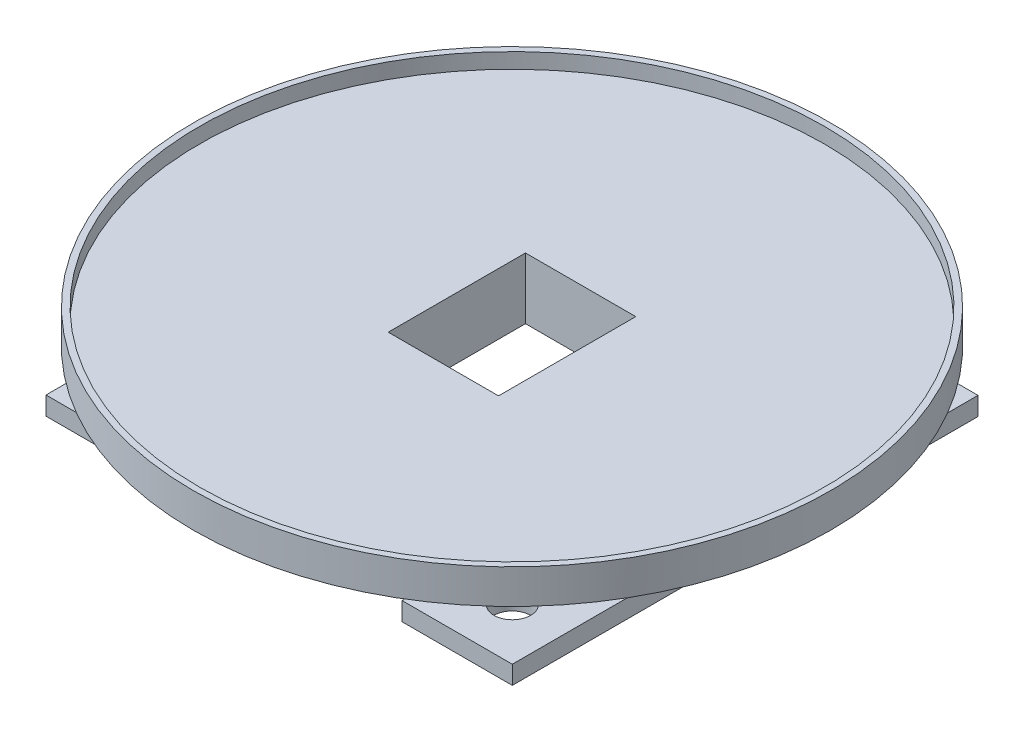
ISO-10303-21;
HEADER;
FILE_DESCRIPTION(('STEP AP214'),'2;1');
FILE_NAME('part.step','',(''),(''),'','','');
FILE_SCHEMA(('AUTOMOTIVE_DESIGN { 1 0 10303 214 1 1 1 1 }'));
ENDSEC;
DATA;
#1=APPLICATION_CONTEXT('core data for automotive mechanical design processes');
#2=APPLICATION_PROTOCOL_DEFINITION('international standard','automotive_design',2000,#1);
#3=PRODUCT_CONTEXT('',#1,'mechanical');
#4=PRODUCT('Part','Part','',(#3));
#5=PRODUCT_RELATED_PRODUCT_CATEGORY('part','',(#4));
#6=PRODUCT_DEFINITION_FORMATION('','',#4);
#7=PRODUCT_DEFINITION_CONTEXT('part definition',#1,'design');
#8=PRODUCT_DEFINITION('design','',#6,#7);
#9=PRODUCT_DEFINITION_SHAPE('','',#8);
#10=(LENGTH_UNIT() NAMED_UNIT(*) SI_UNIT(.MILLI.,.METRE.));
#11=(NAMED_UNIT(*) PLANE_ANGLE_UNIT() SI_UNIT($,.RADIAN.));
#12=(NAMED_UNIT(*) SI_UNIT($,.STERADIAN.) SOLID_ANGLE_UNIT());
#13=UNCERTAINTY_MEASURE_WITH_UNIT(LENGTH_MEASURE(1.E-05),#10,'distance_accuracy_value','');
#14=(GEOMETRIC_REPRESENTATION_CONTEXT(3) GLOBAL_UNCERTAINTY_ASSIGNED_CONTEXT((#13)) GLOBAL_UNIT_ASSIGNED_CONTEXT((#10,
#11,#12)) REPRESENTATION_CONTEXT('',''));
#15=CARTESIAN_POINT('',(0.,0.,0.));
#16=DIRECTION('',(0.,0.,1.));
#17=DIRECTION('',(1.,0.,0.));
#18=AXIS2_PLACEMENT_3D('',#15,#16,#17);
#19=CARTESIAN_POINT('',(0.,-5.,0.));
#20=DIRECTION('',(0.,-1.,0.));
#21=DIRECTION('',(0.,0.,-1.));
#22=AXIS2_PLACEMENT_3D('',#19,#20,#21);
#23=PLANE('',#22);
#24=DIRECTION('',(-1.,0.,0.));
#25=VECTOR('',#24,1.);
#26=CARTESIAN_POINT('',(-4.5,-5.,5.6));
#27=LINE('',#26,#25);
#28=CARTESIAN_POINT('',(4.5,-5.,5.6));
#29=VERTEX_POINT('',#28);
#30=CARTESIAN_POINT('',(-4.5,-5.,5.6));
#31=VERTEX_POINT('',#30);
#32=EDGE_CURVE('E305',#29,#31,#27,.T.);
#33=ORIENTED_EDGE('',*,*,#32,.F.);
#34=DIRECTION('',(0.,0.,1.));
#35=VECTOR('',#34,1.);
#36=CARTESIAN_POINT('',(4.5,-5.,-5.6));
#37=LINE('',#36,#35);
#38=CARTESIAN_POINT('',(4.5,-5.,-5.6));
#39=VERTEX_POINT('',#38);
#40=EDGE_CURVE('E302',#39,#29,#37,.T.);
#41=ORIENTED_EDGE('',*,*,#40,.F.);
#42=DIRECTION('',(1.,0.,0.));
#43=VECTOR('',#42,1.);
#44=CARTESIAN_POINT('',(-4.5,-5.,-5.6));
#45=LINE('',#44,#43);
#46=CARTESIAN_POINT('',(-4.5,-5.,-5.6));
#47=VERTEX_POINT('',#46);
#48=EDGE_CURVE('E312',#47,#39,#45,.T.);
#49=ORIENTED_EDGE('',*,*,#48,.F.);
#50=DIRECTION('',(0.,0.,-1.));
#51=VECTOR('',#50,1.);
#52=CARTESIAN_POINT('',(-4.5,-5.,-5.6));
#53=LINE('',#52,#51);
#54=EDGE_CURVE('E309',#31,#47,#53,.T.);
#55=ORIENTED_EDGE('',*,*,#54,.F.);
#56=EDGE_LOOP('',(#33,#41,#49,#55));
#57=FACE_BOUND('',#56,.T.);
#58=DIRECTION('',(0.,0.,1.));
#59=VECTOR('',#58,1.);
#60=CARTESIAN_POINT('',(-10.025,-5.,-19.));
#61=LINE('',#60,#59);
#62=CARTESIAN_POINT('',(-10.025,-5.,-12.4699388530979));
#63=VERTEX_POINT('',#62);
#64=CARTESIAN_POINT('',(-10.025,-5.,12.4699388530979));
#65=VERTEX_POINT('',#64);
#66=EDGE_CURVE('E266',#63,#65,#61,.T.);
#67=ORIENTED_EDGE('',*,*,#66,.F.);
#68=CARTESIAN_POINT('',(0.,-5.,0.));
#69=DIRECTION('',(0.,-1.,0.));
#70=DIRECTION('',(0.,0.,-1.));
#71=AXIS2_PLACEMENT_3D('',#68,#69,#70);
#72=CIRCLE('',#71,16.);
#73=CARTESIAN_POINT('',(10.025,-5.,-12.4699388530979));
#74=VERTEX_POINT('',#73);
#75=EDGE_CURVE('E255',#63,#74,#72,.T.);
#76=ORIENTED_EDGE('',*,*,#75,.T.);
#77=DIRECTION('',(0.,0.,1.));
#78=VECTOR('',#77,1.);
#79=CARTESIAN_POINT('',(10.025,-5.,-19.));
#80=LINE('',#79,#78);
#81=CARTESIAN_POINT('',(10.025,-5.,12.4699388530979));
#82=VERTEX_POINT('',#81);
#83=EDGE_CURVE('E249',#74,#82,#80,.T.);
#84=ORIENTED_EDGE('',*,*,#83,.T.);
#85=EDGE_CURVE('E258',#82,#65,#72,.T.);
#86=ORIENTED_EDGE('',*,*,#85,.T.);
#87=EDGE_LOOP('',(#67,#76,#84,#86));
#88=FACE_BOUND('',#87,.T.);
#89=ADVANCED_FACE('F109',(#57,#88),#23,.T.);
#90=CARTESIAN_POINT('',(0.,-78.5391052434009,0.));
#91=DIRECTION('',(0.,1.,0.));
#92=DIRECTION('',(0.,0.,1.));
#93=AXIS2_PLACEMENT_3D('',#90,#91,#92);
#94=CYLINDRICAL_SURFACE('',#93,26.);
#95=CARTESIAN_POINT('',(0.,1.25,0.));
#96=DIRECTION('',(0.,1.,0.));
#97=DIRECTION('',(0.,0.,1.));
#98=AXIS2_PLACEMENT_3D('',#95,#96,#97);
#99=CIRCLE('',#98,26.);
#100=CARTESIAN_POINT('',(0.,1.25,26.));
#101=VERTEX_POINT('',#100);
#102=EDGE_CURVE('E716',#101,#101,#99,.T.);
#103=ORIENTED_EDGE('',*,*,#102,.F.);
#104=EDGE_LOOP('',(#103));
#105=FACE_BOUND('',#104,.T.);
#106=CARTESIAN_POINT('',(0.,-1.55,0.));
#107=DIRECTION('',(0.,-1.,0.));
#108=DIRECTION('',(0.,0.,-1.));
#109=AXIS2_PLACEMENT_3D('',#106,#107,#108);
#110=CIRCLE('',#109,26.);
#111=CARTESIAN_POINT('',(0.,-1.55,-26.));
#112=VERTEX_POINT('',#111);
#113=EDGE_CURVE('E270',#112,#112,#110,.T.);
#114=ORIENTED_EDGE('',*,*,#113,.F.);
#115=EDGE_LOOP('',(#114));
#116=FACE_BOUND('',#115,.T.);
#117=ADVANCED_FACE('F351',(#105,#116),#94,.T.);
#118=CARTESIAN_POINT('',(0.,0.,0.));
#119=DIRECTION('',(0.,-1.,0.));
#120=DIRECTION('',(0.,0.,-1.));
#121=AXIS2_PLACEMENT_3D('',#118,#119,#120);
#122=PLANE('',#121);
#123=CARTESIAN_POINT('',(0.,0.,0.));
#124=DIRECTION('',(0.,-1.,0.));
#125=DIRECTION('',(0.,0.,-1.));
#126=AXIS2_PLACEMENT_3D('',#123,#124,#125);
#127=CIRCLE('',#126,25.5);
#128=CARTESIAN_POINT('',(0.,0.,-25.5));
#129=VERTEX_POINT('',#128);
#130=EDGE_CURVE('E113',#129,#129,#127,.T.);
#131=ORIENTED_EDGE('',*,*,#130,.F.);
#132=EDGE_LOOP('',(#131));
#133=FACE_BOUND('',#132,.T.);
#134=DIRECTION('',(0.,0.,1.));
#135=VECTOR('',#134,1.);
#136=CARTESIAN_POINT('',(4.5,0.,-5.6));
#137=LINE('',#136,#135);
#138=CARTESIAN_POINT('',(4.5,0.,-5.6));
#139=VERTEX_POINT('',#138);
#140=CARTESIAN_POINT('',(4.5,0.,5.6));
#141=VERTEX_POINT('',#140);
#142=EDGE_CURVE('E290',#139,#141,#137,.T.);
#143=ORIENTED_EDGE('',*,*,#142,.T.);
#144=DIRECTION('',(-1.,0.,0.));
#145=VECTOR('',#144,1.);
#146=CARTESIAN_POINT('',(-4.5,0.,5.6));
#147=LINE('',#146,#145);
#148=CARTESIAN_POINT('',(-4.5,0.,5.6));
#149=VERTEX_POINT('',#148);
#150=EDGE_CURVE('E319',#141,#149,#147,.T.);
#151=ORIENTED_EDGE('',*,*,#150,.T.);
#152=DIRECTION('',(0.,0.,-1.));
#153=VECTOR('',#152,1.);
#154=CARTESIAN_POINT('',(-4.5,0.,-5.6));
#155=LINE('',#154,#153);
#156=CARTESIAN_POINT('',(-4.5,0.,-5.6));
#157=VERTEX_POINT('',#156);
#158=EDGE_CURVE('E323',#149,#157,#155,.T.);
#159=ORIENTED_EDGE('',*,*,#158,.T.);
#160=DIRECTION('',(1.,0.,0.));
#161=VECTOR('',#160,1.);
#162=CARTESIAN_POINT('',(-4.5,0.,-5.6));
#163=LINE('',#162,#161);
#164=EDGE_CURVE('E306',#157,#139,#163,.T.);
#165=ORIENTED_EDGE('',*,*,#164,.T.);
#166=EDGE_LOOP('',(#143,#151,#159,#165));
#167=FACE_BOUND('',#166,.T.);
#168=ADVANCED_FACE('F111',(#133,#167),#122,.F.);
#169=CARTESIAN_POINT('',(4.5,-5.,-5.6));
#170=DIRECTION('',(-1.,0.,0.));
#171=DIRECTION('',(0.,0.,1.));
#172=AXIS2_PLACEMENT_3D('',#169,#170,#171);
#173=PLANE('',#172);
#174=ORIENTED_EDGE('',*,*,#142,.F.);
#175=DIRECTION('',(0.,1.,0.));
#176=VECTOR('',#175,1.);
#177=CARTESIAN_POINT('',(4.5,-5.,-5.6));
#178=LINE('',#177,#176);
#179=EDGE_CURVE('E315',#39,#139,#178,.T.);
#180=ORIENTED_EDGE('',*,*,#179,.F.);
#181=ORIENTED_EDGE('',*,*,#40,.T.);
#182=DIRECTION('',(0.,1.,0.));
#183=VECTOR('',#182,1.);
#184=CARTESIAN_POINT('',(4.5,-5.,5.6));
#185=LINE('',#184,#183);
#186=EDGE_CURVE('E337',#29,#141,#185,.T.);
#187=ORIENTED_EDGE('',*,*,#186,.T.);
#188=EDGE_LOOP('',(#174,#180,#181,#187));
#189=FACE_BOUND('',#188,.T.);
#190=ADVANCED_FACE('F350',(#189),#173,.T.);
#191=CARTESIAN_POINT('',(-4.5,-5.,5.6));
#192=DIRECTION('',(0.,0.,-1.));
#193=DIRECTION('',(-1.,0.,0.));
#194=AXIS2_PLACEMENT_3D('',#191,#192,#193);
#195=PLANE('',#194);
#196=ORIENTED_EDGE('',*,*,#150,.F.);
#197=ORIENTED_EDGE('',*,*,#186,.F.);
#198=ORIENTED_EDGE('',*,*,#32,.T.);
#199=DIRECTION('',(0.,1.,0.));
#200=VECTOR('',#199,1.);
#201=CARTESIAN_POINT('',(-4.5,-5.,5.6));
#202=LINE('',#201,#200);
#203=EDGE_CURVE('E335',#31,#149,#202,.T.);
#204=ORIENTED_EDGE('',*,*,#203,.T.);
#205=EDGE_LOOP('',(#196,#197,#198,#204));
#206=FACE_BOUND('',#205,.T.);
#207=ADVANCED_FACE('F360',(#206),#195,.T.);
#208=CARTESIAN_POINT('',(-4.5,-5.,-5.6));
#209=DIRECTION('',(1.,0.,0.));
#210=DIRECTION('',(0.,0.,-1.));
#211=AXIS2_PLACEMENT_3D('',#208,#209,#210);
#212=PLANE('',#211);
#213=ORIENTED_EDGE('',*,*,#158,.F.);
#214=ORIENTED_EDGE('',*,*,#203,.F.);
#215=ORIENTED_EDGE('',*,*,#54,.T.);
#216=DIRECTION('',(0.,1.,0.));
#217=VECTOR('',#216,1.);
#218=CARTESIAN_POINT('',(-4.5,-5.,-5.6));
#219=LINE('',#218,#217);
#220=EDGE_CURVE('E135',#47,#157,#219,.T.);
#221=ORIENTED_EDGE('',*,*,#220,.T.);
#222=EDGE_LOOP('',(#213,#214,#215,#221));
#223=FACE_BOUND('',#222,.T.);
#224=ADVANCED_FACE('F364',(#223),#212,.T.);
#225=CARTESIAN_POINT('',(-4.5,-5.,-5.6));
#226=DIRECTION('',(0.,0.,1.));
#227=DIRECTION('',(1.,0.,0.));
#228=AXIS2_PLACEMENT_3D('',#225,#226,#227);
#229=PLANE('',#228);
#230=ORIENTED_EDGE('',*,*,#164,.F.);
#231=ORIENTED_EDGE('',*,*,#220,.F.);
#232=ORIENTED_EDGE('',*,*,#48,.T.);
#233=ORIENTED_EDGE('',*,*,#179,.T.);
#234=EDGE_LOOP('',(#230,#231,#232,#233));
#235=FACE_BOUND('',#234,.T.);
#236=ADVANCED_FACE('F354',(#235),#229,.T.);
#237=CARTESIAN_POINT('',(0.,-5.,0.));
#238=DIRECTION('',(0.,1.,0.));
#239=DIRECTION('',(0.,0.,1.));
#240=AXIS2_PLACEMENT_3D('',#237,#238,#239);
#241=PLANE('',#240);
#242=DIRECTION('',(0.,0.,-1.));
#243=VECTOR('',#242,1.);
#244=CARTESIAN_POINT('',(19.025,-5.,19.));
#245=LINE('',#244,#243);
#246=CARTESIAN_POINT('',(19.025,-5.,19.));
#247=VERTEX_POINT('',#246);
#248=CARTESIAN_POINT('',(19.025,-5.,-19.));
#249=VERTEX_POINT('',#248);
#250=EDGE_CURVE('E12',#247,#249,#245,.T.);
#251=ORIENTED_EDGE('',*,*,#250,.T.);
#252=DIRECTION('',(-1.,0.,0.));
#253=VECTOR('',#252,1.);
#254=CARTESIAN_POINT('',(19.025,-5.,-19.));
#255=LINE('',#254,#253);
#256=CARTESIAN_POINT('',(10.025,-5.00000000000001,-19.));
#257=VERTEX_POINT('',#256);
#258=EDGE_CURVE('E119',#249,#257,#255,.T.);
#259=ORIENTED_EDGE('',*,*,#258,.T.);
#260=EDGE_CURVE('E237',#257,#74,#80,.T.);
#261=ORIENTED_EDGE('',*,*,#260,.T.);
#262=EDGE_CURVE('E241',#74,#82,#72,.T.);
#263=ORIENTED_EDGE('',*,*,#262,.T.);
#264=DIRECTION('',(0.,0.,1.));
#265=VECTOR('',#264,1.);
#266=CARTESIAN_POINT('',(10.025,-5.00000000000001,-19.));
#267=LINE('',#266,#265);
#268=CARTESIAN_POINT('',(10.025,-5.00000000000001,19.));
#269=VERTEX_POINT('',#268);
#270=EDGE_CURVE('E273',#82,#269,#267,.T.);
#271=ORIENTED_EDGE('',*,*,#270,.T.);
#272=DIRECTION('',(-1.,0.,0.));
#273=VECTOR('',#272,1.);
#274=CARTESIAN_POINT('',(19.025,-5.,19.));
#275=LINE('',#274,#273);
#276=EDGE_CURVE('E282',#247,#269,#275,.T.);
#277=ORIENTED_EDGE('',*,*,#276,.F.);
#278=EDGE_LOOP('',(#251,#259,#261,#263,#271,#277));
#279=FACE_BOUND('',#278,.T.);
#280=CARTESIAN_POINT('',(14.825,-5.,-14.8));
#281=DIRECTION('',(0.,-1.,0.));
#282=DIRECTION('',(0.,0.,-1.));
#283=AXIS2_PLACEMENT_3D('',#280,#281,#282);
#284=CIRCLE('',#283,1.5);
#285=CARTESIAN_POINT('',(14.825,-5.,-16.3));
#286=VERTEX_POINT('',#285);
#287=EDGE_CURVE('E690',#286,#286,#284,.T.);
#288=ORIENTED_EDGE('',*,*,#287,.T.);
#289=EDGE_LOOP('',(#288));
#290=FACE_BOUND('',#289,.T.);
#291=CARTESIAN_POINT('',(14.825,-5.,14.8));
#292=DIRECTION('',(0.,-1.,0.));
#293=DIRECTION('',(0.,0.,-1.));
#294=AXIS2_PLACEMENT_3D('',#291,#292,#293);
#295=CIRCLE('',#294,1.5);
#296=CARTESIAN_POINT('',(14.825,-5.,13.3));
#297=VERTEX_POINT('',#296);
#298=EDGE_CURVE('E774',#297,#297,#295,.T.);
#299=ORIENTED_EDGE('',*,*,#298,.T.);
#300=EDGE_LOOP('',(#299));
#301=FACE_BOUND('',#300,.T.);
#302=ADVANCED_FACE('F239',(#279,#290,#301),#241,.T.);
#303=CARTESIAN_POINT('',(0.,-6.5,0.));
#304=DIRECTION('',(0.,1.,0.));
#305=DIRECTION('',(0.,0.,1.));
#306=AXIS2_PLACEMENT_3D('',#303,#304,#305);
#307=PLANE('',#306);
#308=DIRECTION('',(0.,0.,-1.));
#309=VECTOR('',#308,1.);
#310=CARTESIAN_POINT('',(16.8685915988111,-6.5,-7.62390848108858));
#311=LINE('',#310,#309);
#312=CARTESIAN_POINT('',(16.8685915988111,-6.5,-7.62390848108858));
#313=VERTEX_POINT('',#312);
#314=CARTESIAN_POINT('',(16.8685915988111,-6.5,-10.6239084810886));
#315=VERTEX_POINT('',#314);
#316=EDGE_CURVE('E689',#313,#315,#311,.T.);
#317=ORIENTED_EDGE('',*,*,#316,.T.);
#318=DIRECTION('',(1.,0.,0.));
#319=VECTOR('',#318,1.);
#320=CARTESIAN_POINT('',(12.8685915988111,-6.5,-10.6239084810886));
#321=LINE('',#320,#319);
#322=CARTESIAN_POINT('',(12.8685915988111,-6.5,-10.6239084810886));
#323=VERTEX_POINT('',#322);
#324=EDGE_CURVE('E127',#323,#315,#321,.T.);
#325=ORIENTED_EDGE('',*,*,#324,.F.);
#326=DIRECTION('',(0.,0.,-1.));
#327=VECTOR('',#326,1.);
#328=CARTESIAN_POINT('',(12.8685915988111,-6.5,-7.62390848108858));
#329=LINE('',#328,#327);
#330=CARTESIAN_POINT('',(12.8685915988111,-6.5,-7.62390848108858));
#331=VERTEX_POINT('',#330);
#332=EDGE_CURVE('E676',#331,#323,#329,.T.);
#333=ORIENTED_EDGE('',*,*,#332,.F.);
#334=DIRECTION('',(1.,0.,0.));
#335=VECTOR('',#334,1.);
#336=CARTESIAN_POINT('',(12.8685915988111,-6.5,-7.62390848108858));
#337=LINE('',#336,#335);
#338=EDGE_CURVE('E694',#331,#313,#337,.T.);
#339=ORIENTED_EDGE('',*,*,#338,.T.);
#340=EDGE_LOOP('',(#317,#325,#333,#339));
#341=FACE_BOUND('',#340,.T.);
#342=DIRECTION('',(0.,0.,-1.));
#343=VECTOR('',#342,1.);
#344=CARTESIAN_POINT('',(19.025,-6.5,19.));
#345=LINE('',#344,#343);
#346=CARTESIAN_POINT('',(19.025,-6.5,19.));
#347=VERTEX_POINT('',#346);
#348=CARTESIAN_POINT('',(19.025,-6.5,-19.));
#349=VERTEX_POINT('',#348);
#350=EDGE_CURVE('E248',#347,#349,#345,.T.);
#351=ORIENTED_EDGE('',*,*,#350,.F.);
#352=DIRECTION('',(-1.,0.,0.));
#353=VECTOR('',#352,1.);
#354=CARTESIAN_POINT('',(19.025,-6.5,19.));
#355=LINE('',#354,#353);
#356=CARTESIAN_POINT('',(10.025,-6.5,19.));
#357=VERTEX_POINT('',#356);
#358=EDGE_CURVE('E301',#347,#357,#355,.T.);
#359=ORIENTED_EDGE('',*,*,#358,.T.);
#360=DIRECTION('',(0.,0.,1.));
#361=VECTOR('',#360,1.);
#362=CARTESIAN_POINT('',(10.025,-6.5,-19.));
#363=LINE('',#362,#361);
#364=CARTESIAN_POINT('',(10.025,-6.5,-19.));
#365=VERTEX_POINT('',#364);
#366=EDGE_CURVE('E794',#365,#357,#363,.T.);
#367=ORIENTED_EDGE('',*,*,#366,.F.);
#368=DIRECTION('',(-1.,0.,0.));
#369=VECTOR('',#368,1.);
#370=CARTESIAN_POINT('',(19.025,-6.5,-19.));
#371=LINE('',#370,#369);
#372=EDGE_CURVE('E790',#349,#365,#371,.T.);
#373=ORIENTED_EDGE('',*,*,#372,.F.);
#374=EDGE_LOOP('',(#351,#359,#367,#373));
#375=FACE_BOUND('',#374,.T.);
#376=CARTESIAN_POINT('',(14.825,-6.5,-14.8));
#377=DIRECTION('',(0.,-1.,0.));
#378=DIRECTION('',(0.,0.,-1.));
#379=AXIS2_PLACEMENT_3D('',#376,#377,#378);
#380=CIRCLE('',#379,1.5);
#381=CARTESIAN_POINT('',(14.825,-6.5,-16.3));
#382=VERTEX_POINT('',#381);
#383=EDGE_CURVE('E275',#382,#382,#380,.T.);
#384=ORIENTED_EDGE('',*,*,#383,.F.);
#385=EDGE_LOOP('',(#384));
#386=FACE_BOUND('',#385,.T.);
#387=CARTESIAN_POINT('',(14.825,-6.5,14.8));
#388=DIRECTION('',(0.,-1.,0.));
#389=DIRECTION('',(0.,0.,-1.));
#390=AXIS2_PLACEMENT_3D('',#387,#388,#389);
#391=CIRCLE('',#390,1.5);
#392=CARTESIAN_POINT('',(14.825,-6.5,13.3));
#393=VERTEX_POINT('',#392);
#394=EDGE_CURVE('E278',#393,#393,#391,.T.);
#395=ORIENTED_EDGE('',*,*,#394,.F.);
#396=EDGE_LOOP('',(#395));
#397=FACE_BOUND('',#396,.T.);
#398=ADVANCED_FACE('F412',(#341,#375,#386,#397),#307,.F.);
#399=CARTESIAN_POINT('',(19.025,-6.5,19.));
#400=DIRECTION('',(1.,0.,0.));
#401=DIRECTION('',(0.,0.,-1.));
#402=AXIS2_PLACEMENT_3D('',#399,#400,#401);
#403=PLANE('',#402);
#404=ORIENTED_EDGE('',*,*,#250,.F.);
#405=DIRECTION('',(0.,1.,0.));
#406=VECTOR('',#405,1.);
#407=CARTESIAN_POINT('',(19.025,-6.5,19.));
#408=LINE('',#407,#406);
#409=EDGE_CURVE('E286',#347,#247,#408,.T.);
#410=ORIENTED_EDGE('',*,*,#409,.F.);
#411=ORIENTED_EDGE('',*,*,#350,.T.);
#412=DIRECTION('',(0.,1.,0.));
#413=VECTOR('',#412,1.);
#414=CARTESIAN_POINT('',(19.025,-6.5,-19.));
#415=LINE('',#414,#413);
#416=EDGE_CURVE('E297',#349,#249,#415,.T.);
#417=ORIENTED_EDGE('',*,*,#416,.T.);
#418=EDGE_LOOP('',(#404,#410,#411,#417));
#419=FACE_BOUND('',#418,.T.);
#420=ADVANCED_FACE('F427',(#419),#403,.T.);
#421=CARTESIAN_POINT('',(19.025,-6.5,19.));
#422=DIRECTION('',(0.,0.,-1.));
#423=DIRECTION('',(-1.,0.,0.));
#424=AXIS2_PLACEMENT_3D('',#421,#422,#423);
#425=PLANE('',#424);
#426=ORIENTED_EDGE('',*,*,#409,.T.);
#427=ORIENTED_EDGE('',*,*,#276,.T.);
#428=DIRECTION('',(0.,1.,0.));
#429=VECTOR('',#428,1.);
#430=CARTESIAN_POINT('',(10.025,-6.5,19.));
#431=LINE('',#430,#429);
#432=EDGE_CURVE('E291',#357,#269,#431,.T.);
#433=ORIENTED_EDGE('',*,*,#432,.F.);
#434=ORIENTED_EDGE('',*,*,#358,.F.);
#435=EDGE_LOOP('',(#426,#427,#433,#434));
#436=FACE_BOUND('',#435,.T.);
#437=ADVANCED_FACE('F442',(#436),#425,.F.);
#438=CARTESIAN_POINT('',(10.025,-6.5,-19.));
#439=DIRECTION('',(-1.,0.,0.));
#440=DIRECTION('',(0.,0.,1.));
#441=AXIS2_PLACEMENT_3D('',#438,#439,#440);
#442=PLANE('',#441);
#443=ORIENTED_EDGE('',*,*,#260,.F.);
#444=DIRECTION('',(0.,1.,0.));
#445=VECTOR('',#444,1.);
#446=CARTESIAN_POINT('',(10.025,-6.5,-19.));
#447=LINE('',#446,#445);
#448=EDGE_CURVE('E294',#365,#257,#447,.T.);
#449=ORIENTED_EDGE('',*,*,#448,.F.);
#450=ORIENTED_EDGE('',*,*,#366,.T.);
#451=ORIENTED_EDGE('',*,*,#432,.T.);
#452=ORIENTED_EDGE('',*,*,#270,.F.);
#453=ORIENTED_EDGE('',*,*,#83,.F.);
#454=EDGE_LOOP('',(#443,#449,#450,#451,#452,#453));
#455=FACE_BOUND('',#454,.T.);
#456=ADVANCED_FACE('F271',(#455),#442,.T.);
#457=CARTESIAN_POINT('',(19.025,-6.5,-19.));
#458=DIRECTION('',(0.,0.,-1.));
#459=DIRECTION('',(-1.,0.,0.));
#460=AXIS2_PLACEMENT_3D('',#457,#458,#459);
#461=PLANE('',#460);
#462=ORIENTED_EDGE('',*,*,#258,.F.);
#463=ORIENTED_EDGE('',*,*,#416,.F.);
#464=ORIENTED_EDGE('',*,*,#372,.T.);
#465=ORIENTED_EDGE('',*,*,#448,.T.);
#466=EDGE_LOOP('',(#462,#463,#464,#465));
#467=FACE_BOUND('',#466,.T.);
#468=ADVANCED_FACE('F461',(#467),#461,.T.);
#469=CARTESIAN_POINT('',(14.825,-6.5,-14.8));
#470=DIRECTION('',(0.,1.,0.));
#471=DIRECTION('',(0.,0.,1.));
#472=AXIS2_PLACEMENT_3D('',#469,#470,#471);
#473=CYLINDRICAL_SURFACE('',#472,1.5);
#474=ORIENTED_EDGE('',*,*,#383,.T.);
#475=EDGE_LOOP('',(#474));
#476=FACE_BOUND('',#475,.T.);
#477=ORIENTED_EDGE('',*,*,#287,.F.);
#478=EDGE_LOOP('',(#477));
#479=FACE_BOUND('',#478,.T.);
#480=ADVANCED_FACE('F470',(#476,#479),#473,.F.);
#481=CARTESIAN_POINT('',(14.825,-6.5,14.8));
#482=DIRECTION('',(0.,1.,0.));
#483=DIRECTION('',(0.,0.,1.));
#484=AXIS2_PLACEMENT_3D('',#481,#482,#483);
#485=CYLINDRICAL_SURFACE('',#484,1.5);
#486=ORIENTED_EDGE('',*,*,#394,.T.);
#487=EDGE_LOOP('',(#486));
#488=FACE_BOUND('',#487,.T.);
#489=ORIENTED_EDGE('',*,*,#298,.F.);
#490=EDGE_LOOP('',(#489));
#491=FACE_BOUND('',#490,.T.);
#492=ADVANCED_FACE('F480',(#488,#491),#485,.F.);
#493=CARTESIAN_POINT('',(0.,-5.,0.));
#494=DIRECTION('',(0.,-1.,0.));
#495=DIRECTION('',(0.,0.,-1.));
#496=AXIS2_PLACEMENT_3D('',#493,#494,#495);
#497=PLANE('',#496);
#498=DIRECTION('',(0.,0.,-1.));
#499=VECTOR('',#498,1.);
#500=CARTESIAN_POINT('',(-19.025,-5.,19.));
#501=LINE('',#500,#499);
#502=CARTESIAN_POINT('',(-19.025,-5.,19.));
#503=VERTEX_POINT('',#502);
#504=CARTESIAN_POINT('',(-19.025,-5.,-19.));
#505=VERTEX_POINT('',#504);
#506=EDGE_CURVE('E743',#503,#505,#501,.T.);
#507=ORIENTED_EDGE('',*,*,#506,.F.);
#508=DIRECTION('',(-1.,0.,0.));
#509=VECTOR('',#508,1.);
#510=CARTESIAN_POINT('',(-10.025,-5.,19.));
#511=LINE('',#510,#509);
#512=CARTESIAN_POINT('',(-10.025,-5.00000000000001,19.));
#513=VERTEX_POINT('',#512);
#514=EDGE_CURVE('E740',#513,#503,#511,.T.);
#515=ORIENTED_EDGE('',*,*,#514,.F.);
#516=DIRECTION('',(0.,0.,1.));
#517=VECTOR('',#516,1.);
#518=CARTESIAN_POINT('',(-10.025,-5.00000000000001,-19.));
#519=LINE('',#518,#517);
#520=EDGE_CURVE('E260',#65,#513,#519,.T.);
#521=ORIENTED_EDGE('',*,*,#520,.F.);
#522=EDGE_CURVE('E269',#65,#63,#72,.T.);
#523=ORIENTED_EDGE('',*,*,#522,.T.);
#524=CARTESIAN_POINT('',(-10.025,-5.00000000000001,-19.));
#525=VERTEX_POINT('',#524);
#526=EDGE_CURVE('E737',#525,#63,#61,.T.);
#527=ORIENTED_EDGE('',*,*,#526,.F.);
#528=DIRECTION('',(-1.,0.,0.));
#529=VECTOR('',#528,1.);
#530=CARTESIAN_POINT('',(-10.025,-5.,-19.));
#531=LINE('',#530,#529);
#532=EDGE_CURVE('E747',#525,#505,#531,.T.);
#533=ORIENTED_EDGE('',*,*,#532,.T.);
#534=EDGE_LOOP('',(#507,#515,#521,#523,#527,#533));
#535=FACE_BOUND('',#534,.T.);
#536=CARTESIAN_POINT('',(-15.175,-5.,-14.8));
#537=DIRECTION('',(0.,1.,0.));
#538=DIRECTION('',(0.,0.,1.));
#539=AXIS2_PLACEMENT_3D('',#536,#537,#538);
#540=CIRCLE('',#539,1.5);
#541=CARTESIAN_POINT('',(-15.175,-5.,-13.3));
#542=VERTEX_POINT('',#541);
#543=EDGE_CURVE('E670',#542,#542,#540,.T.);
#544=ORIENTED_EDGE('',*,*,#543,.F.);
#545=EDGE_LOOP('',(#544));
#546=FACE_BOUND('',#545,.T.);
#547=CARTESIAN_POINT('',(-15.175,-5.,14.8));
#548=DIRECTION('',(0.,1.,0.));
#549=DIRECTION('',(0.,0.,1.));
#550=AXIS2_PLACEMENT_3D('',#547,#548,#549);
#551=CIRCLE('',#550,1.5);
#552=CARTESIAN_POINT('',(-15.175,-5.,16.3));
#553=VERTEX_POINT('',#552);
#554=EDGE_CURVE('E766',#553,#553,#551,.T.);
#555=ORIENTED_EDGE('',*,*,#554,.F.);
#556=EDGE_LOOP('',(#555));
#557=FACE_BOUND('',#556,.T.);
#558=ADVANCED_FACE('F490',(#535,#546,#557),#497,.F.);
#559=CARTESIAN_POINT('',(-10.025,-6.5,-19.));
#560=DIRECTION('',(0.,0.,-1.));
#561=DIRECTION('',(-1.,0.,0.));
#562=AXIS2_PLACEMENT_3D('',#559,#560,#561);
#563=PLANE('',#562);
#564=ORIENTED_EDGE('',*,*,#532,.F.);
#565=DIRECTION('',(0.,1.,0.));
#566=VECTOR('',#565,1.);
#567=CARTESIAN_POINT('',(-10.025,-6.5,-19.));
#568=LINE('',#567,#566);
#569=CARTESIAN_POINT('',(-10.025,-6.5,-19.));
#570=VERTEX_POINT('',#569);
#571=EDGE_CURVE('E720',#570,#525,#568,.T.);
#572=ORIENTED_EDGE('',*,*,#571,.F.);
#573=DIRECTION('',(-1.,0.,0.));
#574=VECTOR('',#573,1.);
#575=CARTESIAN_POINT('',(-10.025,-6.5,-19.));
#576=LINE('',#575,#574);
#577=CARTESIAN_POINT('',(-19.025,-6.5,-19.));
#578=VERTEX_POINT('',#577);
#579=EDGE_CURVE('E759',#570,#578,#576,.T.);
#580=ORIENTED_EDGE('',*,*,#579,.T.);
#581=DIRECTION('',(0.,1.,0.));
#582=VECTOR('',#581,1.);
#583=CARTESIAN_POINT('',(-19.025,-6.5,-19.));
#584=LINE('',#583,#582);
#585=EDGE_CURVE('E721',#578,#505,#584,.T.);
#586=ORIENTED_EDGE('',*,*,#585,.T.);
#587=EDGE_LOOP('',(#564,#572,#580,#586));
#588=FACE_BOUND('',#587,.T.);
#589=ADVANCED_FACE('F500',(#588),#563,.T.);
#590=CARTESIAN_POINT('',(-10.025,-6.5,-19.));
#591=DIRECTION('',(-1.,0.,0.));
#592=DIRECTION('',(0.,0.,1.));
#593=AXIS2_PLACEMENT_3D('',#590,#591,#592);
#594=PLANE('',#593);
#595=ORIENTED_EDGE('',*,*,#526,.T.);
#596=ORIENTED_EDGE('',*,*,#66,.T.);
#597=ORIENTED_EDGE('',*,*,#520,.T.);
#598=DIRECTION('',(0.,1.,0.));
#599=VECTOR('',#598,1.);
#600=CARTESIAN_POINT('',(-10.025,-6.5,19.));
#601=LINE('',#600,#599);
#602=CARTESIAN_POINT('',(-10.025,-6.5,19.));
#603=VERTEX_POINT('',#602);
#604=EDGE_CURVE('E730',#603,#513,#601,.T.);
#605=ORIENTED_EDGE('',*,*,#604,.F.);
#606=DIRECTION('',(0.,0.,1.));
#607=VECTOR('',#606,1.);
#608=CARTESIAN_POINT('',(-10.025,-6.5,-19.));
#609=LINE('',#608,#607);
#610=EDGE_CURVE('E725',#570,#603,#609,.T.);
#611=ORIENTED_EDGE('',*,*,#610,.F.);
#612=ORIENTED_EDGE('',*,*,#571,.T.);
#613=EDGE_LOOP('',(#595,#596,#597,#605,#611,#612));
#614=FACE_BOUND('',#613,.T.);
#615=ADVANCED_FACE('F512',(#614),#594,.F.);
#616=CARTESIAN_POINT('',(-10.025,-6.5,19.));
#617=DIRECTION('',(0.,0.,-1.));
#618=DIRECTION('',(-1.,0.,0.));
#619=AXIS2_PLACEMENT_3D('',#616,#617,#618);
#620=PLANE('',#619);
#621=ORIENTED_EDGE('',*,*,#514,.T.);
#622=DIRECTION('',(0.,1.,0.));
#623=VECTOR('',#622,1.);
#624=CARTESIAN_POINT('',(-19.025,-6.5,19.));
#625=LINE('',#624,#623);
#626=CARTESIAN_POINT('',(-19.025,-6.5,19.));
#627=VERTEX_POINT('',#626);
#628=EDGE_CURVE('E726',#627,#503,#625,.T.);
#629=ORIENTED_EDGE('',*,*,#628,.F.);
#630=DIRECTION('',(-1.,0.,0.));
#631=VECTOR('',#630,1.);
#632=CARTESIAN_POINT('',(-10.025,-6.5,19.));
#633=LINE('',#632,#631);
#634=EDGE_CURVE('E753',#603,#627,#633,.T.);
#635=ORIENTED_EDGE('',*,*,#634,.F.);
#636=ORIENTED_EDGE('',*,*,#604,.T.);
#637=EDGE_LOOP('',(#621,#629,#635,#636));
#638=FACE_BOUND('',#637,.T.);
#639=ADVANCED_FACE('F522',(#638),#620,.F.);
#640=CARTESIAN_POINT('',(-19.025,-6.5,19.));
#641=DIRECTION('',(1.,0.,0.));
#642=DIRECTION('',(0.,0.,-1.));
#643=AXIS2_PLACEMENT_3D('',#640,#641,#642);
#644=PLANE('',#643);
#645=ORIENTED_EDGE('',*,*,#506,.T.);
#646=ORIENTED_EDGE('',*,*,#585,.F.);
#647=DIRECTION('',(0.,0.,-1.));
#648=VECTOR('',#647,1.);
#649=CARTESIAN_POINT('',(-19.025,-6.5,19.));
#650=LINE('',#649,#648);
#651=EDGE_CURVE('E756',#627,#578,#650,.T.);
#652=ORIENTED_EDGE('',*,*,#651,.F.);
#653=ORIENTED_EDGE('',*,*,#628,.T.);
#654=EDGE_LOOP('',(#645,#646,#652,#653));
#655=FACE_BOUND('',#654,.T.);
#656=ADVANCED_FACE('F532',(#655),#644,.F.);
#657=CARTESIAN_POINT('',(0.,-6.5,0.));
#658=DIRECTION('',(0.,-1.,0.));
#659=DIRECTION('',(0.,0.,-1.));
#660=AXIS2_PLACEMENT_3D('',#657,#658,#659);
#661=PLANE('',#660);
#662=CARTESIAN_POINT('',(-15.175,-6.5,14.8));
#663=DIRECTION('',(0.,1.,0.));
#664=DIRECTION('',(0.,0.,1.));
#665=AXIS2_PLACEMENT_3D('',#662,#663,#664);
#666=CIRCLE('',#665,1.5);
#667=CARTESIAN_POINT('',(-15.175,-6.5,16.3));
#668=VERTEX_POINT('',#667);
#669=EDGE_CURVE('E770',#668,#668,#666,.T.);
#670=ORIENTED_EDGE('',*,*,#669,.T.);
#671=EDGE_LOOP('',(#670));
#672=FACE_BOUND('',#671,.T.);
#673=CARTESIAN_POINT('',(-15.175,-6.5,-14.8));
#674=DIRECTION('',(0.,1.,0.));
#675=DIRECTION('',(0.,0.,1.));
#676=AXIS2_PLACEMENT_3D('',#673,#674,#675);
#677=CIRCLE('',#676,1.5);
#678=CARTESIAN_POINT('',(-15.175,-6.5,-13.3));
#679=VERTEX_POINT('',#678);
#680=EDGE_CURVE('E750',#679,#679,#677,.T.);
#681=ORIENTED_EDGE('',*,*,#680,.T.);
#682=EDGE_LOOP('',(#681));
#683=FACE_BOUND('',#682,.T.);
#684=ORIENTED_EDGE('',*,*,#579,.F.);
#685=ORIENTED_EDGE('',*,*,#610,.T.);
#686=ORIENTED_EDGE('',*,*,#634,.T.);
#687=ORIENTED_EDGE('',*,*,#651,.T.);
#688=EDGE_LOOP('',(#684,#685,#686,#687));
#689=FACE_BOUND('',#688,.T.);
#690=ADVANCED_FACE('F542',(#672,#683,#689),#661,.T.);
#691=CARTESIAN_POINT('',(-15.175,-6.5,-14.8));
#692=DIRECTION('',(0.,1.,0.));
#693=DIRECTION('',(0.,0.,1.));
#694=AXIS2_PLACEMENT_3D('',#691,#692,#693);
#695=CYLINDRICAL_SURFACE('',#694,1.5);
#696=ORIENTED_EDGE('',*,*,#680,.F.);
#697=EDGE_LOOP('',(#696));
#698=FACE_BOUND('',#697,.T.);
#699=ORIENTED_EDGE('',*,*,#543,.T.);
#700=EDGE_LOOP('',(#699));
#701=FACE_BOUND('',#700,.T.);
#702=ADVANCED_FACE('F552',(#698,#701),#695,.F.);
#703=CARTESIAN_POINT('',(-15.175,-6.5,14.8));
#704=DIRECTION('',(0.,1.,0.));
#705=DIRECTION('',(0.,0.,1.));
#706=AXIS2_PLACEMENT_3D('',#703,#704,#705);
#707=CYLINDRICAL_SURFACE('',#706,1.5);
#708=ORIENTED_EDGE('',*,*,#669,.F.);
#709=EDGE_LOOP('',(#708));
#710=FACE_BOUND('',#709,.T.);
#711=ORIENTED_EDGE('',*,*,#554,.T.);
#712=EDGE_LOOP('',(#711));
#713=FACE_BOUND('',#712,.T.);
#714=ADVANCED_FACE('F562',(#710,#713),#707,.F.);
#715=CARTESIAN_POINT('',(0.,-78.5391052434009,0.));
#716=DIRECTION('',(0.,1.,0.));
#717=DIRECTION('',(0.,0.,1.));
#718=AXIS2_PLACEMENT_3D('',#715,#716,#717);
#719=CYLINDRICAL_SURFACE('',#718,25.5);
#720=CARTESIAN_POINT('',(0.,1.25,0.));
#721=DIRECTION('',(0.,1.,0.));
#722=DIRECTION('',(0.,0.,1.));
#723=AXIS2_PLACEMENT_3D('',#720,#721,#722);
#724=CIRCLE('',#723,25.5);
#725=CARTESIAN_POINT('',(0.,1.25,25.5));
#726=VERTEX_POINT('',#725);
#727=EDGE_CURVE('E704',#726,#726,#724,.T.);
#728=ORIENTED_EDGE('',*,*,#727,.T.);
#729=EDGE_LOOP('',(#728));
#730=FACE_BOUND('',#729,.T.);
#731=ORIENTED_EDGE('',*,*,#130,.T.);
#732=EDGE_LOOP('',(#731));
#733=FACE_BOUND('',#732,.T.);
#734=ADVANCED_FACE('F346',(#730,#733),#719,.F.);
#735=CARTESIAN_POINT('',(0.,1.25,0.));
#736=DIRECTION('',(0.,1.,0.));
#737=DIRECTION('',(0.,0.,1.));
#738=AXIS2_PLACEMENT_3D('',#735,#736,#737);
#739=PLANE('',#738);
#740=ORIENTED_EDGE('',*,*,#102,.T.);
#741=EDGE_LOOP('',(#740));
#742=FACE_BOUND('',#741,.T.);
#743=ORIENTED_EDGE('',*,*,#727,.F.);
#744=EDGE_LOOP('',(#743));
#745=FACE_BOUND('',#744,.T.);
#746=ADVANCED_FACE('F581',(#742,#745),#739,.T.);
#747=CARTESIAN_POINT('',(12.8685915988111,-5.8,-10.6239084810886));
#748=DIRECTION('',(0.,0.,-1.));
#749=DIRECTION('',(-1.,0.,0.));
#750=AXIS2_PLACEMENT_3D('',#747,#748,#749);
#751=PLANE('',#750);
#752=ORIENTED_EDGE('',*,*,#324,.T.);
#753=DIRECTION('',(0.,-1.,0.));
#754=VECTOR('',#753,1.);
#755=CARTESIAN_POINT('',(16.8685915988111,-5.8,-10.6239084810886));
#756=LINE('',#755,#754);
#757=CARTESIAN_POINT('',(16.8685915988111,-5.8,-10.6239084810886));
#758=VERTEX_POINT('',#757);
#759=EDGE_CURVE('E686',#758,#315,#756,.T.);
#760=ORIENTED_EDGE('',*,*,#759,.F.);
#761=DIRECTION('',(1.,0.,0.));
#762=VECTOR('',#761,1.);
#763=CARTESIAN_POINT('',(12.8685915988111,-5.8,-10.6239084810886));
#764=LINE('',#763,#762);
#765=CARTESIAN_POINT('',(12.8685915988111,-5.8,-10.6239084810886));
#766=VERTEX_POINT('',#765);
#767=EDGE_CURVE('E671',#766,#758,#764,.T.);
#768=ORIENTED_EDGE('',*,*,#767,.F.);
#769=DIRECTION('',(0.,-1.,0.));
#770=VECTOR('',#769,1.);
#771=CARTESIAN_POINT('',(12.8685915988111,-5.8,-10.6239084810886));
#772=LINE('',#771,#770);
#773=EDGE_CURVE('E701',#766,#323,#772,.T.);
#774=ORIENTED_EDGE('',*,*,#773,.T.);
#775=EDGE_LOOP('',(#752,#760,#768,#774));
#776=FACE_BOUND('',#775,.T.);
#777=ADVANCED_FACE('F590',(#776),#751,.F.);
#778=CARTESIAN_POINT('',(12.8685915988111,-5.8,-7.62390848108858));
#779=DIRECTION('',(-1.,0.,0.));
#780=DIRECTION('',(0.,0.,1.));
#781=AXIS2_PLACEMENT_3D('',#778,#779,#780);
#782=PLANE('',#781);
#783=ORIENTED_EDGE('',*,*,#332,.T.);
#784=ORIENTED_EDGE('',*,*,#773,.F.);
#785=DIRECTION('',(0.,0.,-1.));
#786=VECTOR('',#785,1.);
#787=CARTESIAN_POINT('',(12.8685915988111,-5.8,-7.62390848108858));
#788=LINE('',#787,#786);
#789=CARTESIAN_POINT('',(12.8685915988111,-5.8,-7.62390848108858));
#790=VERTEX_POINT('',#789);
#791=EDGE_CURVE('E682',#790,#766,#788,.T.);
#792=ORIENTED_EDGE('',*,*,#791,.F.);
#793=DIRECTION('',(0.,-1.,0.));
#794=VECTOR('',#793,1.);
#795=CARTESIAN_POINT('',(12.8685915988111,-5.8,-7.62390848108858));
#796=LINE('',#795,#794);
#797=EDGE_CURVE('E705',#790,#331,#796,.T.);
#798=ORIENTED_EDGE('',*,*,#797,.T.);
#799=EDGE_LOOP('',(#783,#784,#792,#798));
#800=FACE_BOUND('',#799,.T.);
#801=ADVANCED_FACE('F599',(#800),#782,.F.);
#802=CARTESIAN_POINT('',(12.8685915988111,-5.8,-7.62390848108858));
#803=DIRECTION('',(0.,0.,-1.));
#804=DIRECTION('',(-1.,0.,0.));
#805=AXIS2_PLACEMENT_3D('',#802,#803,#804);
#806=PLANE('',#805);
#807=ORIENTED_EDGE('',*,*,#338,.F.);
#808=ORIENTED_EDGE('',*,*,#797,.F.);
#809=DIRECTION('',(1.,0.,0.));
#810=VECTOR('',#809,1.);
#811=CARTESIAN_POINT('',(12.8685915988111,-5.8,-7.62390848108858));
#812=LINE('',#811,#810);
#813=CARTESIAN_POINT('',(16.8685915988111,-5.8,-7.62390848108858));
#814=VERTEX_POINT('',#813);
#815=EDGE_CURVE('E679',#790,#814,#812,.T.);
#816=ORIENTED_EDGE('',*,*,#815,.T.);
#817=DIRECTION('',(0.,-1.,0.));
#818=VECTOR('',#817,1.);
#819=CARTESIAN_POINT('',(16.8685915988111,-5.8,-7.62390848108858));
#820=LINE('',#819,#818);
#821=EDGE_CURVE('E708',#814,#313,#820,.T.);
#822=ORIENTED_EDGE('',*,*,#821,.T.);
#823=EDGE_LOOP('',(#807,#808,#816,#822));
#824=FACE_BOUND('',#823,.T.);
#825=ADVANCED_FACE('F608',(#824),#806,.T.);
#826=CARTESIAN_POINT('',(16.8685915988111,-5.8,-7.62390848108858));
#827=DIRECTION('',(-1.,0.,0.));
#828=DIRECTION('',(0.,0.,1.));
#829=AXIS2_PLACEMENT_3D('',#826,#827,#828);
#830=PLANE('',#829);
#831=ORIENTED_EDGE('',*,*,#316,.F.);
#832=ORIENTED_EDGE('',*,*,#821,.F.);
#833=DIRECTION('',(0.,0.,-1.));
#834=VECTOR('',#833,1.);
#835=CARTESIAN_POINT('',(16.8685915988111,-5.8,-7.62390848108858));
#836=LINE('',#835,#834);
#837=EDGE_CURVE('E675',#814,#758,#836,.T.);
#838=ORIENTED_EDGE('',*,*,#837,.T.);
#839=ORIENTED_EDGE('',*,*,#759,.T.);
#840=EDGE_LOOP('',(#831,#832,#838,#839));
#841=FACE_BOUND('',#840,.T.);
#842=ADVANCED_FACE('F618',(#841),#830,.T.);
#843=CARTESIAN_POINT('',(0.,-5.8,0.));
#844=DIRECTION('',(0.,1.,0.));
#845=DIRECTION('',(0.,0.,1.));
#846=AXIS2_PLACEMENT_3D('',#843,#844,#845);
#847=PLANE('',#846);
#848=ORIENTED_EDGE('',*,*,#767,.T.);
#849=ORIENTED_EDGE('',*,*,#837,.F.);
#850=ORIENTED_EDGE('',*,*,#815,.F.);
#851=ORIENTED_EDGE('',*,*,#791,.T.);
#852=EDGE_LOOP('',(#848,#849,#850,#851));
#853=FACE_BOUND('',#852,.T.);
#854=ADVANCED_FACE('F628',(#853),#847,.F.);
#855=CARTESIAN_POINT('',(0.,-31.1904361546092,0.));
#856=DIRECTION('',(0.,-1.,0.));
#857=DIRECTION('',(0.,0.,-1.));
#858=AXIS2_PLACEMENT_3D('',#855,#856,#857);
#859=TOROIDAL_SURFACE('',#858,30.6308254733402,30.);
#860=ORIENTED_EDGE('',*,*,#113,.T.);
#861=EDGE_LOOP('',(#860));
#862=FACE_BOUND('',#861,.T.);
#863=ORIENTED_EDGE('',*,*,#262,.F.);
#864=ORIENTED_EDGE('',*,*,#75,.F.);
#865=ORIENTED_EDGE('',*,*,#522,.F.);
#866=ORIENTED_EDGE('',*,*,#85,.F.);
#867=EDGE_LOOP('',(#863,#864,#865,#866));
#868=FACE_BOUND('',#867,.T.);
#869=ADVANCED_FACE('F253',(#862,#868),#859,.F.);
#870=CLOSED_SHELL('',(#89,#117,#168,#190,#207,#224,#236,#302,#398,#420,#437,#456,#468,#480,#492,
#558,#589,#615,#639,#656,#690,#702,#714,#734,#746,#777,#801,#825,#842,#854,#869));
#871=MANIFOLD_SOLID_BREP('B2',#870);
#872=ADVANCED_BREP_SHAPE_REPRESENTATION('',(#18,#871),#14);
#873=SHAPE_DEFINITION_REPRESENTATION(#9,#872);
ENDSEC;
END-ISO-10303-21;
